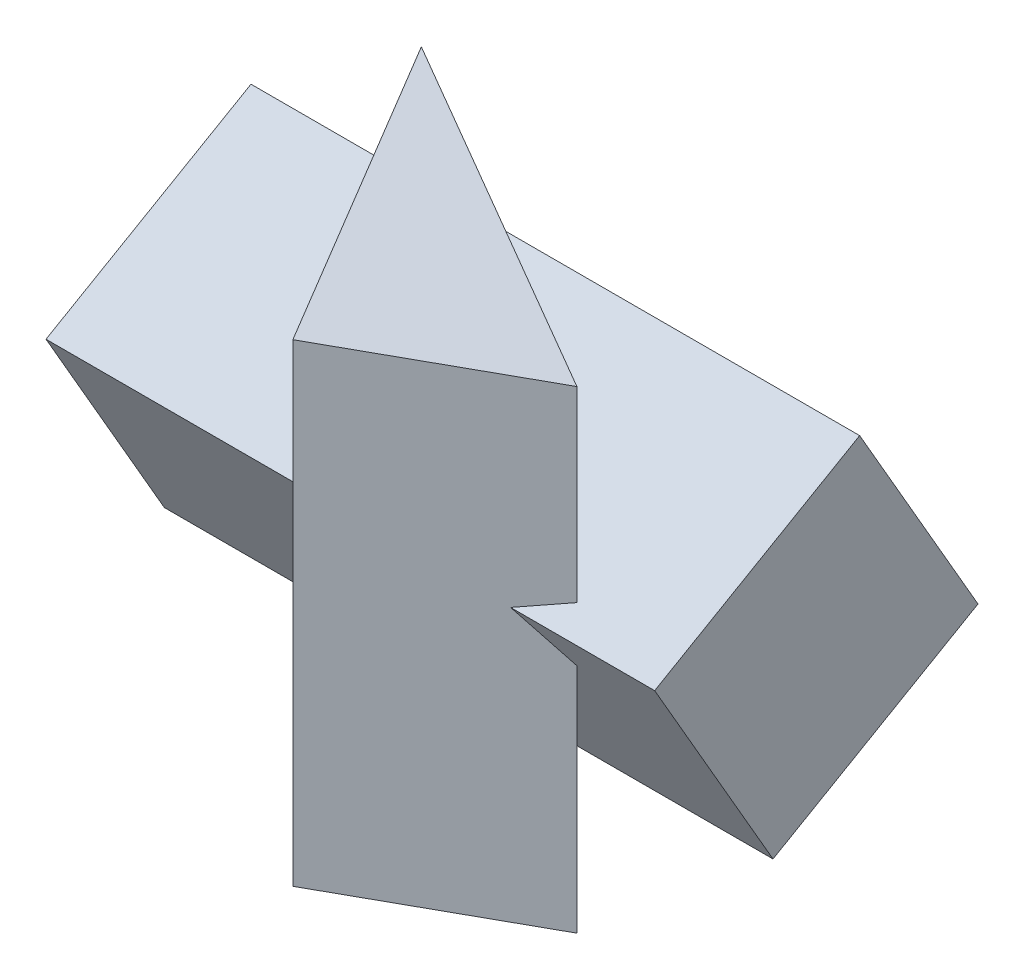
ISO-10303-21;
HEADER;
FILE_DESCRIPTION(('STEP AP214'),'2;1');
FILE_NAME('part.step','',(''),(''),'','','');
FILE_SCHEMA(('AUTOMOTIVE_DESIGN { 1 0 10303 214 1 1 1 1 }'));
ENDSEC;
DATA;
#1=APPLICATION_CONTEXT('core data for automotive mechanical design processes');
#2=APPLICATION_PROTOCOL_DEFINITION('international standard','automotive_design',2000,#1);
#3=PRODUCT_CONTEXT('',#1,'mechanical');
#4=PRODUCT('Part','Part','',(#3));
#5=PRODUCT_RELATED_PRODUCT_CATEGORY('part','',(#4));
#6=PRODUCT_DEFINITION_FORMATION('','',#4);
#7=PRODUCT_DEFINITION_CONTEXT('part definition',#1,'design');
#8=PRODUCT_DEFINITION('design','',#6,#7);
#9=PRODUCT_DEFINITION_SHAPE('','',#8);
#10=(LENGTH_UNIT() NAMED_UNIT(*) SI_UNIT(.MILLI.,.METRE.));
#11=(NAMED_UNIT(*) PLANE_ANGLE_UNIT() SI_UNIT($,.RADIAN.));
#12=(NAMED_UNIT(*) SI_UNIT($,.STERADIAN.) SOLID_ANGLE_UNIT());
#13=UNCERTAINTY_MEASURE_WITH_UNIT(LENGTH_MEASURE(1.E-05),#10,'distance_accuracy_value','');
#14=(GEOMETRIC_REPRESENTATION_CONTEXT(3) GLOBAL_UNCERTAINTY_ASSIGNED_CONTEXT((#13)) GLOBAL_UNIT_ASSIGNED_CONTEXT((#10,
#11,#12)) REPRESENTATION_CONTEXT('',''));
#15=CARTESIAN_POINT('',(0.,0.,0.));
#16=DIRECTION('',(0.,0.,1.));
#17=DIRECTION('',(1.,0.,0.));
#18=AXIS2_PLACEMENT_3D('',#15,#16,#17);
#19=CARTESIAN_POINT('',(-15.,70.,14.));
#20=DIRECTION('',(-0.502893578303637,0.,0.864348337709377));
#21=DIRECTION('',(0.864348337709377,0.,0.502893578303638));
#22=AXIS2_PLACEMENT_3D('',#19,#20,#21);
#23=PLANE('',#22);
#24=DIRECTION('',(-0.830068516637426,0.278830709251754,-0.482948955134502));
#25=VECTOR('',#24,1.);
#26=CARTESIAN_POINT('',(-30.7576922996943,7.21030809522059,4.83188811654148));
#27=LINE('',#26,#25);
#28=CARTESIAN_POINT('',(-39.0625,9.99999999999999,0.));
#29=VERTEX_POINT('',#28);
#30=CARTESIAN_POINT('',(-70.,20.3923048454133,-18.));
#31=VERTEX_POINT('',#30);
#32=EDGE_CURVE('E174',#29,#31,#27,.T.);
#33=ORIENTED_EDGE('',*,*,#32,.F.);
#34=DIRECTION('',(0.651766743287987,0.656810539088577,0.379209741549374));
#35=VECTOR('',#34,1.);
#36=CARTESIAN_POINT('',(0.304671433685389,49.6718202608972,22.9045361068715));
#37=LINE('',#36,#35);
#38=CARTESIAN_POINT('',(-15.,34.2487113059642,14.));
#39=VERTEX_POINT('',#38);
#40=EDGE_CURVE('E168',#29,#39,#37,.T.);
#41=ORIENTED_EDGE('',*,*,#40,.T.);
#42=DIRECTION('',(0.,-1.,0.));
#43=VECTOR('',#42,1.);
#44=CARTESIAN_POINT('',(-15.,70.,14.));
#45=LINE('',#44,#43);
#46=CARTESIAN_POINT('',(-15.,0.,14.));
#47=VERTEX_POINT('',#46);
#48=EDGE_CURVE('E195',#39,#47,#45,.T.);
#49=ORIENTED_EDGE('',*,*,#48,.T.);
#50=DIRECTION('',(-0.864348337709377,0.,-0.502893578303638));
#51=VECTOR('',#50,1.);
#52=CARTESIAN_POINT('',(-15.,0.,14.));
#53=LINE('',#52,#51);
#54=CARTESIAN_POINT('',(-70.,0.,-18.));
#55=VERTEX_POINT('',#54);
#56=EDGE_CURVE('E186',#47,#55,#53,.T.);
#57=ORIENTED_EDGE('',*,*,#56,.T.);
#58=DIRECTION('',(0.,-1.,0.));
#59=VECTOR('',#58,1.);
#60=CARTESIAN_POINT('',(-70.,70.,-18.));
#61=LINE('',#60,#59);
#62=EDGE_CURVE('E191',#31,#55,#61,.T.);
#63=ORIENTED_EDGE('',*,*,#62,.F.);
#64=EDGE_LOOP('',(#33,#41,#49,#57,#63));
#65=FACE_BOUND('',#64,.T.);
#66=ADVANCED_FACE('F33',(#65),#23,.F.);
#67=DIRECTION('',(0.651766743287987,0.656810539088577,0.379209741549374));
#68=VECTOR('',#67,1.);
#69=CARTESIAN_POINT('',(-29.6614371876438,89.4738143628492,5.46970927264361));
#70=LINE('',#69,#68);
#71=CARTESIAN_POINT('',(-70.,48.8230854637602,-18.));
#72=VERTEX_POINT('',#71);
#73=CARTESIAN_POINT('',(-61.0812156964075,57.8108891324554,-12.8108891324553));
#74=VERTEX_POINT('',#73);
#75=EDGE_CURVE('E176',#72,#74,#70,.T.);
#76=ORIENTED_EDGE('',*,*,#75,.F.);
#77=CARTESIAN_POINT('',(-70.,70.,-18.));
#78=VERTEX_POINT('',#77);
#79=EDGE_CURVE('E192',#78,#72,#61,.T.);
#80=ORIENTED_EDGE('',*,*,#79,.F.);
#81=DIRECTION('',(-0.864348337709377,0.,-0.502893578303638));
#82=VECTOR('',#81,1.);
#83=CARTESIAN_POINT('',(-15.,70.,14.));
#84=LINE('',#83,#82);
#85=CARTESIAN_POINT('',(-15.,70.,14.));
#86=VERTEX_POINT('',#85);
#87=EDGE_CURVE('E79',#86,#78,#84,.T.);
#88=ORIENTED_EDGE('',*,*,#87,.F.);
#89=CARTESIAN_POINT('',(-15.,42.3316150746191,14.));
#90=VERTEX_POINT('',#89);
#91=EDGE_CURVE('E196',#86,#90,#45,.T.);
#92=ORIENTED_EDGE('',*,*,#91,.T.);
#93=DIRECTION('',(-0.830068516637426,0.278830709251754,-0.482948955134502));
#94=VECTOR('',#93,1.);
#95=CARTESIAN_POINT('',(-21.4038087676922,44.4827369456683,10.27414762607));
#96=LINE('',#95,#94);
#97=EDGE_CURVE('E157',#90,#74,#96,.T.);
#98=ORIENTED_EDGE('',*,*,#97,.T.);
#99=EDGE_LOOP('',(#76,#80,#88,#92,#98));
#100=FACE_BOUND('',#99,.T.);
#101=ADVANCED_FACE('F255',(#100),#23,.F.);
#102=CARTESIAN_POINT('',(-70.,70.,-18.));
#103=DIRECTION('',(0.859101543908756,0.,-0.511805175094578));
#104=DIRECTION('',(-0.511805175094578,0.,-0.859101543908756));
#105=AXIS2_PLACEMENT_3D('',#102,#103,#104);
#106=PLANE('',#105);
#107=DIRECTION('',(-0.285476586600166,-0.829986348609022,-0.479192841793135));
#108=VECTOR('',#107,1.);
#109=CARTESIAN_POINT('',(-64.9823065101462,63.4113819951179,-9.57744307060252));
#110=LINE('',#109,#108);
#111=CARTESIAN_POINT('',(-66.9086148023138,57.8108891324554,-12.8108891324553));
#112=VERTEX_POINT('',#111);
#113=EDGE_CURVE('E11',#112,#72,#110,.T.);
#114=ORIENTED_EDGE('',*,*,#113,.F.);
#115=DIRECTION('',(0.458503262071271,-0.444346362275536,0.769630475619632));
#116=VECTOR('',#115,1.);
#117=CARTESIAN_POINT('',(-71.8729649415122,62.6219583393566,-21.1439054375383));
#118=LINE('',#117,#116);
#119=CARTESIAN_POINT('',(-48.8510638297872,40.3108891324553,17.5));
#120=VERTEX_POINT('',#119);
#121=EDGE_CURVE('E198',#112,#120,#118,.T.);
#122=ORIENTED_EDGE('',*,*,#121,.T.);
#123=DIRECTION('',(-0.285476586600166,-0.829986348609022,-0.479192841793135));
#124=VECTOR('',#123,1.);
#125=CARTESIAN_POINT('',(-48.3963896293515,41.6327957165315,18.26320312216));
#126=LINE('',#125,#124);
#127=CARTESIAN_POINT('',(-59.2765957446809,10.,0.));
#128=VERTEX_POINT('',#127);
#129=EDGE_CURVE('E201',#120,#128,#126,.T.);
#130=ORIENTED_EDGE('',*,*,#129,.T.);
#131=DIRECTION('',(0.458503262071271,-0.444346362275536,0.769630475619632));
#132=VECTOR('',#131,1.);
#133=CARTESIAN_POINT('',(-80.1067868936038,30.1870312126355,-34.9649637142634));
#134=LINE('',#133,#132);
#135=EDGE_CURVE('E41',#31,#128,#134,.T.);
#136=ORIENTED_EDGE('',*,*,#135,.F.);
#137=ORIENTED_EDGE('',*,*,#62,.T.);
#138=DIRECTION('',(0.511805175094578,0.,0.859101543908756));
#139=VECTOR('',#138,1.);
#140=CARTESIAN_POINT('',(-70.,0.,-18.));
#141=LINE('',#140,#139);
#142=CARTESIAN_POINT('',(-42.,0.,29.));
#143=VERTEX_POINT('',#142);
#144=EDGE_CURVE('E73',#55,#143,#141,.T.);
#145=ORIENTED_EDGE('',*,*,#144,.T.);
#146=DIRECTION('',(0.,-1.,0.));
#147=VECTOR('',#146,1.);
#148=CARTESIAN_POINT('',(-42.,70.,29.));
#149=LINE('',#148,#147);
#150=CARTESIAN_POINT('',(-42.,70.,29.));
#151=VERTEX_POINT('',#150);
#152=EDGE_CURVE('E183',#151,#143,#149,.T.);
#153=ORIENTED_EDGE('',*,*,#152,.F.);
#154=DIRECTION('',(0.511805175094578,0.,0.859101543908756));
#155=VECTOR('',#154,1.);
#156=CARTESIAN_POINT('',(-70.,70.,-18.));
#157=LINE('',#156,#155);
#158=EDGE_CURVE('E57',#78,#151,#157,.T.);
#159=ORIENTED_EDGE('',*,*,#158,.F.);
#160=ORIENTED_EDGE('',*,*,#79,.T.);
#161=EDGE_LOOP('',(#114,#122,#130,#136,#137,#145,#153,#159,#160));
#162=FACE_BOUND('',#161,.T.);
#163=ADVANCED_FACE('F209',(#162),#106,.F.);
#164=CARTESIAN_POINT('',(-42.,70.,29.));
#165=DIRECTION('',(-0.485642931178632,0.,-0.874157276121538));
#166=DIRECTION('',(-0.874157276121538,0.,0.485642931178632));
#167=AXIS2_PLACEMENT_3D('',#164,#165,#166);
#168=PLANE('',#167);
#169=ORIENTED_EDGE('',*,*,#48,.F.);
#170=DIRECTION('',(-0.668964731622451,0.643711613134311,0.371647073123584));
#171=VECTOR('',#170,1.);
#172=CARTESIAN_POINT('',(-46.2073877372154,64.2780341572746,31.3374376317863));
#173=LINE('',#172,#171);
#174=CARTESIAN_POINT('',(-21.3000000000001,40.3108891324553,17.5));
#175=VERTEX_POINT('',#174);
#176=EDGE_CURVE('E171',#39,#175,#173,.T.);
#177=ORIENTED_EDGE('',*,*,#176,.T.);
#178=DIRECTION('',(0.841697576624542,0.26997462357802,-0.467609764791412));
#179=VECTOR('',#178,1.);
#180=CARTESIAN_POINT('',(-33.7447895614111,36.319221019517,24.4137719785618));
#181=LINE('',#180,#179);
#182=EDGE_CURVE('E160',#175,#90,#181,.T.);
#183=ORIENTED_EDGE('',*,*,#182,.T.);
#184=ORIENTED_EDGE('',*,*,#91,.F.);
#185=DIRECTION('',(0.874157276121538,0.,-0.485642931178632));
#186=VECTOR('',#185,1.);
#187=CARTESIAN_POINT('',(-42.,70.,29.));
#188=LINE('',#187,#186);
#189=EDGE_CURVE('E179',#151,#86,#188,.T.);
#190=ORIENTED_EDGE('',*,*,#189,.F.);
#191=ORIENTED_EDGE('',*,*,#152,.T.);
#192=DIRECTION('',(0.874157276121538,0.,-0.485642931178632));
#193=VECTOR('',#192,1.);
#194=CARTESIAN_POINT('',(-42.,0.,29.));
#195=LINE('',#194,#193);
#196=EDGE_CURVE('E178',#143,#47,#195,.T.);
#197=ORIENTED_EDGE('',*,*,#196,.T.);
#198=EDGE_LOOP('',(#169,#177,#183,#184,#190,#191,#197));
#199=FACE_BOUND('',#198,.T.);
#200=ADVANCED_FACE('F35',(#199),#168,.F.);
#201=CARTESIAN_POINT('',(0.,70.,0.));
#202=DIRECTION('',(0.,-1.,0.));
#203=DIRECTION('',(0.,0.,-1.));
#204=AXIS2_PLACEMENT_3D('',#201,#202,#203);
#205=PLANE('',#204);
#206=ORIENTED_EDGE('',*,*,#189,.T.);
#207=ORIENTED_EDGE('',*,*,#87,.T.);
#208=ORIENTED_EDGE('',*,*,#158,.T.);
#209=EDGE_LOOP('',(#206,#207,#208));
#210=FACE_BOUND('',#209,.T.);
#211=ADVANCED_FACE('F245',(#210),#205,.F.);
#212=CARTESIAN_POINT('',(0.,0.,0.));
#213=DIRECTION('',(0.,-1.,0.));
#214=DIRECTION('',(0.,0.,-1.));
#215=AXIS2_PLACEMENT_3D('',#212,#213,#214);
#216=PLANE('',#215);
#217=ORIENTED_EDGE('',*,*,#196,.F.);
#218=ORIENTED_EDGE('',*,*,#144,.F.);
#219=ORIENTED_EDGE('',*,*,#56,.F.);
#220=EDGE_LOOP('',(#217,#218,#219));
#221=FACE_BOUND('',#220,.T.);
#222=ADVANCED_FACE('F243',(#221),#216,.T.);
#223=CARTESIAN_POINT('',(-90.,57.8108891324554,-12.8108891324553));
#224=DIRECTION('',(0.,-0.500000000000001,0.866025403784438));
#225=DIRECTION('',(0.,-0.866025403784438,-0.500000000000001));
#226=AXIS2_PLACEMENT_3D('',#223,#224,#225);
#227=PLANE('',#226);
#228=ORIENTED_EDGE('',*,*,#113,.T.);
#229=ORIENTED_EDGE('',*,*,#75,.T.);
#230=DIRECTION('',(1.,0.,0.));
#231=VECTOR('',#230,1.);
#232=CARTESIAN_POINT('',(-90.,57.8108891324554,-12.8108891324553));
#233=LINE('',#232,#231);
#234=CARTESIAN_POINT('',(0.,57.8108891324554,-12.8108891324553));
#235=VERTEX_POINT('',#234);
#236=EDGE_CURVE('E214',#74,#235,#233,.T.);
#237=ORIENTED_EDGE('',*,*,#236,.T.);
#238=DIRECTION('',(0.,-0.866025403784438,-0.500000000000001));
#239=VECTOR('',#238,1.);
#240=CARTESIAN_POINT('',(0.,57.8108891324554,-12.8108891324553));
#241=LINE('',#240,#239);
#242=CARTESIAN_POINT('',(0.,27.5,-30.3108891324553));
#243=VERTEX_POINT('',#242);
#244=EDGE_CURVE('E156',#235,#243,#241,.T.);
#245=ORIENTED_EDGE('',*,*,#244,.T.);
#246=DIRECTION('',(1.,0.,0.));
#247=VECTOR('',#246,1.);
#248=CARTESIAN_POINT('',(-90.,27.5,-30.3108891324553));
#249=LINE('',#248,#247);
#250=CARTESIAN_POINT('',(-90.,27.5,-30.3108891324553));
#251=VERTEX_POINT('',#250);
#252=EDGE_CURVE('E136',#251,#243,#249,.T.);
#253=ORIENTED_EDGE('',*,*,#252,.F.);
#254=DIRECTION('',(0.,-0.866025403784438,-0.500000000000001));
#255=VECTOR('',#254,1.);
#256=CARTESIAN_POINT('',(-90.,57.8108891324554,-12.8108891324553));
#257=LINE('',#256,#255);
#258=CARTESIAN_POINT('',(-90.,57.8108891324554,-12.8108891324553));
#259=VERTEX_POINT('',#258);
#260=EDGE_CURVE('E144',#259,#251,#257,.T.);
#261=ORIENTED_EDGE('',*,*,#260,.F.);
#262=EDGE_CURVE('E211',#259,#112,#233,.T.);
#263=ORIENTED_EDGE('',*,*,#262,.T.);
#264=EDGE_LOOP('',(#228,#229,#237,#245,#253,#261,#263));
#265=FACE_BOUND('',#264,.T.);
#266=ADVANCED_FACE('F154',(#265),#227,.F.);
#267=CARTESIAN_POINT('',(-90.,27.5,-30.3108891324553));
#268=DIRECTION('',(0.,0.866025403784438,0.500000000000001));
#269=DIRECTION('',(0.,-0.500000000000001,0.866025403784438));
#270=AXIS2_PLACEMENT_3D('',#267,#268,#269);
#271=PLANE('',#270);
#272=DIRECTION('',(1.,0.,0.));
#273=VECTOR('',#272,1.);
#274=CARTESIAN_POINT('',(-90.,10.,0.));
#275=LINE('',#274,#273);
#276=CARTESIAN_POINT('',(0.,10.,0.));
#277=VERTEX_POINT('',#276);
#278=EDGE_CURVE('E162',#29,#277,#275,.T.);
#279=ORIENTED_EDGE('',*,*,#278,.F.);
#280=ORIENTED_EDGE('',*,*,#32,.T.);
#281=ORIENTED_EDGE('',*,*,#135,.T.);
#282=CARTESIAN_POINT('',(-90.,10.,0.));
#283=VERTEX_POINT('',#282);
#284=EDGE_CURVE('E139',#283,#128,#275,.T.);
#285=ORIENTED_EDGE('',*,*,#284,.F.);
#286=DIRECTION('',(0.,-0.500000000000001,0.866025403784438));
#287=VECTOR('',#286,1.);
#288=CARTESIAN_POINT('',(-90.,27.5,-30.3108891324553));
#289=LINE('',#288,#287);
#290=EDGE_CURVE('E130',#251,#283,#289,.T.);
#291=ORIENTED_EDGE('',*,*,#290,.F.);
#292=ORIENTED_EDGE('',*,*,#252,.T.);
#293=DIRECTION('',(0.,-0.500000000000001,0.866025403784438));
#294=VECTOR('',#293,1.);
#295=CARTESIAN_POINT('',(0.,27.5,-30.3108891324553));
#296=LINE('',#295,#294);
#297=EDGE_CURVE('E225',#243,#277,#296,.T.);
#298=ORIENTED_EDGE('',*,*,#297,.T.);
#299=EDGE_LOOP('',(#279,#280,#281,#285,#291,#292,#298));
#300=FACE_BOUND('',#299,.T.);
#301=ADVANCED_FACE('F133',(#300),#271,.F.);
#302=CARTESIAN_POINT('',(-90.,40.3108891324553,17.5));
#303=DIRECTION('',(0.,-0.500000000000001,0.866025403784438));
#304=DIRECTION('',(0.,-0.866025403784438,-0.500000000000001));
#305=AXIS2_PLACEMENT_3D('',#302,#303,#304);
#306=PLANE('',#305);
#307=ORIENTED_EDGE('',*,*,#176,.F.);
#308=ORIENTED_EDGE('',*,*,#40,.F.);
#309=ORIENTED_EDGE('',*,*,#278,.T.);
#310=DIRECTION('',(0.,-0.866025403784438,-0.500000000000001));
#311=VECTOR('',#310,1.);
#312=CARTESIAN_POINT('',(0.,40.3108891324553,17.5));
#313=LINE('',#312,#311);
#314=CARTESIAN_POINT('',(0.,40.3108891324553,17.5));
#315=VERTEX_POINT('',#314);
#316=EDGE_CURVE('E223',#315,#277,#313,.T.);
#317=ORIENTED_EDGE('',*,*,#316,.F.);
#318=DIRECTION('',(1.,0.,0.));
#319=VECTOR('',#318,1.);
#320=CARTESIAN_POINT('',(-90.,40.3108891324553,17.5));
#321=LINE('',#320,#319);
#322=EDGE_CURVE('E213',#175,#315,#321,.T.);
#323=ORIENTED_EDGE('',*,*,#322,.F.);
#324=EDGE_LOOP('',(#307,#308,#309,#317,#323));
#325=FACE_BOUND('',#324,.T.);
#326=ADVANCED_FACE('F220',(#325),#306,.T.);
#327=ORIENTED_EDGE('',*,*,#129,.F.);
#328=CARTESIAN_POINT('',(-90.,40.3108891324553,17.5));
#329=VERTEX_POINT('',#328);
#330=EDGE_CURVE('E48',#329,#120,#321,.T.);
#331=ORIENTED_EDGE('',*,*,#330,.F.);
#332=DIRECTION('',(0.,-0.866025403784438,-0.500000000000001));
#333=VECTOR('',#332,1.);
#334=CARTESIAN_POINT('',(-90.,40.3108891324553,17.5));
#335=LINE('',#334,#333);
#336=EDGE_CURVE('E143',#329,#283,#335,.T.);
#337=ORIENTED_EDGE('',*,*,#336,.T.);
#338=ORIENTED_EDGE('',*,*,#284,.T.);
#339=EDGE_LOOP('',(#327,#331,#337,#338));
#340=FACE_BOUND('',#339,.T.);
#341=ADVANCED_FACE('F207',(#340),#306,.T.);
#342=CARTESIAN_POINT('',(-90.,57.8108891324554,-12.8108891324553));
#343=DIRECTION('',(0.,0.866025403784438,0.500000000000001));
#344=DIRECTION('',(0.,-0.500000000000001,0.866025403784438));
#345=AXIS2_PLACEMENT_3D('',#342,#343,#344);
#346=PLANE('',#345);
#347=ORIENTED_EDGE('',*,*,#182,.F.);
#348=ORIENTED_EDGE('',*,*,#322,.T.);
#349=DIRECTION('',(0.,-0.500000000000001,0.866025403784438));
#350=VECTOR('',#349,1.);
#351=CARTESIAN_POINT('',(0.,57.8108891324554,-12.8108891324553));
#352=LINE('',#351,#350);
#353=EDGE_CURVE('E152',#235,#315,#352,.T.);
#354=ORIENTED_EDGE('',*,*,#353,.F.);
#355=ORIENTED_EDGE('',*,*,#236,.F.);
#356=ORIENTED_EDGE('',*,*,#97,.F.);
#357=EDGE_LOOP('',(#347,#348,#354,#355,#356));
#358=FACE_BOUND('',#357,.T.);
#359=ADVANCED_FACE('F235',(#358),#346,.T.);
#360=ORIENTED_EDGE('',*,*,#121,.F.);
#361=ORIENTED_EDGE('',*,*,#262,.F.);
#362=DIRECTION('',(0.,-0.500000000000001,0.866025403784438));
#363=VECTOR('',#362,1.);
#364=CARTESIAN_POINT('',(-90.,57.8108891324554,-12.8108891324553));
#365=LINE('',#364,#363);
#366=EDGE_CURVE('E149',#259,#329,#365,.T.);
#367=ORIENTED_EDGE('',*,*,#366,.T.);
#368=ORIENTED_EDGE('',*,*,#330,.T.);
#369=EDGE_LOOP('',(#360,#361,#367,#368));
#370=FACE_BOUND('',#369,.T.);
#371=ADVANCED_FACE('F210',(#370),#346,.T.);
#372=CARTESIAN_POINT('',(-90.,0.,0.));
#373=DIRECTION('',(-1.,0.,0.));
#374=DIRECTION('',(0.,0.,1.));
#375=AXIS2_PLACEMENT_3D('',#372,#373,#374);
#376=PLANE('',#375);
#377=ORIENTED_EDGE('',*,*,#260,.T.);
#378=ORIENTED_EDGE('',*,*,#290,.T.);
#379=ORIENTED_EDGE('',*,*,#336,.F.);
#380=ORIENTED_EDGE('',*,*,#366,.F.);
#381=EDGE_LOOP('',(#377,#378,#379,#380));
#382=FACE_BOUND('',#381,.T.);
#383=ADVANCED_FACE('F148',(#382),#376,.T.);
#384=CARTESIAN_POINT('',(0.,0.,0.));
#385=DIRECTION('',(-1.,0.,0.));
#386=DIRECTION('',(0.,0.,1.));
#387=AXIS2_PLACEMENT_3D('',#384,#385,#386);
#388=PLANE('',#387);
#389=ORIENTED_EDGE('',*,*,#244,.F.);
#390=ORIENTED_EDGE('',*,*,#353,.T.);
#391=ORIENTED_EDGE('',*,*,#316,.T.);
#392=ORIENTED_EDGE('',*,*,#297,.F.);
#393=EDGE_LOOP('',(#389,#390,#391,#392));
#394=FACE_BOUND('',#393,.T.);
#395=ADVANCED_FACE('F228',(#394),#388,.F.);
#396=CLOSED_SHELL('',(#66,#101,#163,#200,#211,#222,#266,#301,#326,#341,#359,#371,#383,#395));
#397=MANIFOLD_SOLID_BREP('B2',#396);
#398=ADVANCED_BREP_SHAPE_REPRESENTATION('',(#18,#397),#14);
#399=SHAPE_DEFINITION_REPRESENTATION(#9,#398);
ENDSEC;
END-ISO-10303-21;
